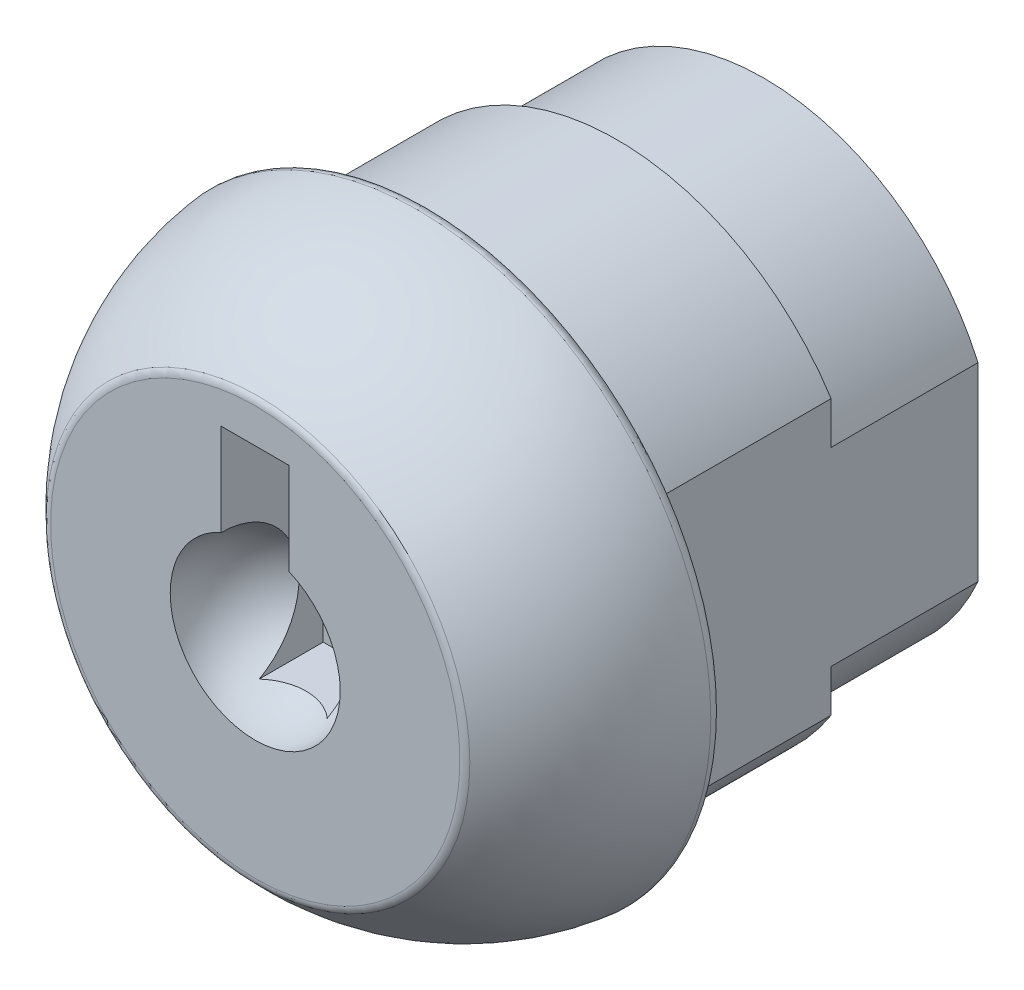
ISO-10303-21;
HEADER;
FILE_DESCRIPTION(('STEP AP214'),'2;1');
FILE_NAME('part.step','',(''),(''),'','','');
FILE_SCHEMA(('AUTOMOTIVE_DESIGN { 1 0 10303 214 1 1 1 1 }'));
ENDSEC;
DATA;
#1=APPLICATION_CONTEXT('core data for automotive mechanical design processes');
#2=APPLICATION_PROTOCOL_DEFINITION('international standard','automotive_design',2000,#1);
#3=PRODUCT_CONTEXT('',#1,'mechanical');
#4=PRODUCT('Part','Part','',(#3));
#5=PRODUCT_RELATED_PRODUCT_CATEGORY('part','',(#4));
#6=PRODUCT_DEFINITION_FORMATION('','',#4);
#7=PRODUCT_DEFINITION_CONTEXT('part definition',#1,'design');
#8=PRODUCT_DEFINITION('design','',#6,#7);
#9=PRODUCT_DEFINITION_SHAPE('','',#8);
#10=(LENGTH_UNIT() NAMED_UNIT(*) SI_UNIT(.MILLI.,.METRE.));
#11=(NAMED_UNIT(*) PLANE_ANGLE_UNIT() SI_UNIT($,.RADIAN.));
#12=(NAMED_UNIT(*) SI_UNIT($,.STERADIAN.) SOLID_ANGLE_UNIT());
#13=UNCERTAINTY_MEASURE_WITH_UNIT(LENGTH_MEASURE(1.E-05),#10,'distance_accuracy_value','');
#14=(GEOMETRIC_REPRESENTATION_CONTEXT(3) GLOBAL_UNCERTAINTY_ASSIGNED_CONTEXT((#13)) GLOBAL_UNIT_ASSIGNED_CONTEXT((#10,
#11,#12)) REPRESENTATION_CONTEXT('',''));
#15=CARTESIAN_POINT('',(0.,0.,0.));
#16=DIRECTION('',(0.,0.,1.));
#17=DIRECTION('',(1.,0.,0.));
#18=AXIS2_PLACEMENT_3D('',#15,#16,#17);
#19=CARTESIAN_POINT('',(0.,1.905,-3.81));
#20=DIRECTION('',(0.,0.,-1.));
#21=DIRECTION('',(-1.,0.,0.));
#22=AXIS2_PLACEMENT_3D('',#19,#20,#21);
#23=PLANE('',#22);
#24=DIRECTION('',(1.,0.,0.));
#25=VECTOR('',#24,1.);
#26=CARTESIAN_POINT('',(1.27,-2.54,-3.81));
#27=LINE('',#26,#25);
#28=CARTESIAN_POINT('',(-1.27,-2.54,-3.81));
#29=VERTEX_POINT('',#28);
#30=CARTESIAN_POINT('',(1.27,-2.54,-3.81));
#31=VERTEX_POINT('',#30);
#32=EDGE_CURVE('E132',#29,#31,#27,.T.);
#33=ORIENTED_EDGE('',*,*,#32,.T.);
#34=DIRECTION('',(0.,1.,0.));
#35=VECTOR('',#34,1.);
#36=CARTESIAN_POINT('',(1.26999999999999,6.35,-3.81));
#37=LINE('',#36,#35);
#38=CARTESIAN_POINT('',(1.26999999999999,6.35,-3.81));
#39=VERTEX_POINT('',#38);
#40=EDGE_CURVE('E140',#31,#39,#37,.T.);
#41=ORIENTED_EDGE('',*,*,#40,.T.);
#42=DIRECTION('',(1.,0.,0.));
#43=VECTOR('',#42,1.);
#44=CARTESIAN_POINT('',(-1.27,6.35,-3.81));
#45=LINE('',#44,#43);
#46=CARTESIAN_POINT('',(-1.27,6.35,-3.81));
#47=VERTEX_POINT('',#46);
#48=EDGE_CURVE('E133',#39,#47,#45,.F.);
#49=ORIENTED_EDGE('',*,*,#48,.T.);
#50=DIRECTION('',(0.,-1.,0.));
#51=VECTOR('',#50,1.);
#52=CARTESIAN_POINT('',(-1.27,-2.54,-3.81));
#53=LINE('',#52,#51);
#54=EDGE_CURVE('E151',#47,#29,#53,.T.);
#55=ORIENTED_EDGE('',*,*,#54,.T.);
#56=EDGE_LOOP('',(#33,#41,#49,#55));
#57=FACE_BOUND('',#56,.T.);
#58=ADVANCED_FACE('F17',(#57),#23,.F.);
#59=CARTESIAN_POINT('',(1.27,-2.54,0.));
#60=DIRECTION('',(0.,-1.,0.));
#61=DIRECTION('',(0.,0.,-1.));
#62=AXIS2_PLACEMENT_3D('',#59,#60,#61);
#63=PLANE('',#62);
#64=DIRECTION('',(0.,0.,1.));
#65=VECTOR('',#64,1.);
#66=CARTESIAN_POINT('',(1.27,-2.54,0.));
#67=LINE('',#66,#65);
#68=CARTESIAN_POINT('',(1.27,-2.54,-1.41990316571237));
#69=VERTEX_POINT('',#68);
#70=EDGE_CURVE('E144',#69,#31,#67,.F.);
#71=ORIENTED_EDGE('',*,*,#70,.T.);
#72=ORIENTED_EDGE('',*,*,#32,.F.);
#73=DIRECTION('',(0.,0.,1.));
#74=VECTOR('',#73,1.);
#75=CARTESIAN_POINT('',(-1.27,-2.54,0.));
#76=LINE('',#75,#74);
#77=CARTESIAN_POINT('',(-1.27,-2.54,-1.41990316571237));
#78=VERTEX_POINT('',#77);
#79=EDGE_CURVE('E137',#29,#78,#76,.T.);
#80=ORIENTED_EDGE('',*,*,#79,.T.);
#81=CARTESIAN_POINT('',(-1.27,-2.54,-1.41990316571237));
#82=CARTESIAN_POINT('',(-1.23005239120285,-2.53999999999996,-1.45563291230035));
#83=CARTESIAN_POINT('',(-1.18861561779617,-2.53999999999998,-1.48965920558386));
#84=CARTESIAN_POINT('',(-1.10302665983604,-2.54000000000002,-1.55410091556853));
#85=CARTESIAN_POINT('',(-1.05887460526792,-2.54000000000004,-1.58451650491651));
#86=CARTESIAN_POINT('',(-0.922877908145627,-2.53999999999992,-1.66995571271265));
#87=CARTESIAN_POINT('',(-0.827364296598273,-2.53999999999959,-1.71928641837805));
#88=CARTESIAN_POINT('',(-0.629412647813625,-2.5399999999996,-1.80121084091261));
#89=CARTESIAN_POINT('',(-0.526971245354933,-2.53999999999993,-1.83379635664315));
#90=CARTESIAN_POINT('',(-0.318085130877129,-2.54000000000007,-1.88130522008903));
#91=CARTESIAN_POINT('',(-0.211641452001605,-2.53999999999987,-1.89623309406985));
#92=CARTESIAN_POINT('',(0.00222574017568847,-2.53999999999983,-1.90800731092913));
#93=CARTESIAN_POINT('',(0.109649151579861,-2.53999999999998,-1.90485551325671));
#94=CARTESIAN_POINT('',(0.322497234244716,-2.54000000000002,-1.88055721191501));
#95=CARTESIAN_POINT('',(0.427920958750327,-2.5399999999999,-1.85940239186337));
#96=CARTESIAN_POINT('',(0.633759582405878,-2.5399999999999,-1.79968689943814));
#97=CARTESIAN_POINT('',(0.734171733447887,-2.54000000000002,-1.76111679131695));
#98=CARTESIAN_POINT('',(0.926995575443043,-2.53999999999998,-1.66767647457572));
#99=CARTESIAN_POINT('',(1.01941939561519,-2.53999999999983,-1.61283155917503));
#100=CARTESIAN_POINT('',(1.13493921988193,-2.53999999999992,-1.53041401042046));
#101=CARTESIAN_POINT('',(1.16282365004706,-2.53999999999997,-1.50933454702979));
#102=CARTESIAN_POINT('',(1.21734618272097,-2.54000000000003,-1.46571025642878));
#103=CARTESIAN_POINT('',(1.24398626833384,-2.54000000000004,-1.44316790788703));
#104=CARTESIAN_POINT('',(1.27,-2.54,-1.41990316571237));
#105=B_SPLINE_CURVE_WITH_KNOTS('',3,(#81,#82,#83,#84,#85,#86,#87,#88,#89,#90,#91,#92,#93,#94,
#95,#96,#97,#98,#99,#100,#101,#102,#103,#104),.UNSPECIFIED.,.F.,.F.,(4,2,2,2,2,2,2,2,2,2,2,4),
(0.,0.160686303204169,0.321364920049631,0.642212241852082,0.963216552710838,1.28413856119691,
1.60502756424722,1.92606488045706,2.24727634645931,2.56799119846663,2.67281974393884,
2.77747508810238),.UNSPECIFIED.);
#106=EDGE_CURVE('E213',#78,#69,#105,.T.);
#107=ORIENTED_EDGE('',*,*,#106,.T.);
#108=EDGE_LOOP('',(#71,#72,#80,#107));
#109=FACE_BOUND('',#108,.T.);
#110=ADVANCED_FACE('F221',(#109),#63,.F.);
#111=CARTESIAN_POINT('',(0.,8.7503,-13.5128));
#112=DIRECTION('',(0.,0.,-1.));
#113=DIRECTION('',(-1.,0.,0.));
#114=AXIS2_PLACEMENT_3D('',#111,#112,#113);
#115=PLANE('',#114);
#116=DIRECTION('',(0.,1.,0.));
#117=VECTOR('',#116,1.);
#118=CARTESIAN_POINT('',(-8.001,8.7503,-13.5128));
#119=LINE('',#118,#117);
#120=CARTESIAN_POINT('',(-8.001,3.54284477362473,-13.5128));
#121=VERTEX_POINT('',#120);
#122=CARTESIAN_POINT('',(-8.001,5.12191360723705,-13.5128));
#123=VERTEX_POINT('',#122);
#124=EDGE_CURVE('E92',#121,#123,#119,.T.);
#125=ORIENTED_EDGE('',*,*,#124,.T.);
#126=CARTESIAN_POINT('',(0.,0.,-13.5128));
#127=DIRECTION('',(0.,0.,-1.));
#128=DIRECTION('',(-1.,0.,0.));
#129=AXIS2_PLACEMENT_3D('',#126,#127,#128);
#130=CIRCLE('',#129,9.5);
#131=CARTESIAN_POINT('',(8.001,5.12191360723705,-13.5128));
#132=VERTEX_POINT('',#131);
#133=EDGE_CURVE('E129',#132,#123,#130,.F.);
#134=ORIENTED_EDGE('',*,*,#133,.F.);
#135=DIRECTION('',(0.,1.,0.));
#136=VECTOR('',#135,1.);
#137=CARTESIAN_POINT('',(8.001,8.7503,-13.5128));
#138=LINE('',#137,#136);
#139=CARTESIAN_POINT('',(8.001,3.54284477362474,-13.5128));
#140=VERTEX_POINT('',#139);
#141=EDGE_CURVE('E106',#132,#140,#138,.F.);
#142=ORIENTED_EDGE('',*,*,#141,.T.);
#143=CARTESIAN_POINT('',(0.,0.,-13.5128));
#144=DIRECTION('',(0.,0.,-1.));
#145=DIRECTION('',(-1.,0.,0.));
#146=AXIS2_PLACEMENT_3D('',#143,#144,#145);
#147=CIRCLE('',#146,8.7503);
#148=EDGE_CURVE('E21',#121,#140,#147,.T.);
#149=ORIENTED_EDGE('',*,*,#148,.F.);
#150=EDGE_LOOP('',(#125,#134,#142,#149));
#151=FACE_BOUND('',#150,.T.);
#152=ADVANCED_FACE('F110',(#151),#115,.T.);
#153=CARTESIAN_POINT('',(0.,8.7503,-13.5128));
#154=DIRECTION('',(0.,0.,-1.));
#155=DIRECTION('',(-1.,0.,0.));
#156=AXIS2_PLACEMENT_3D('',#153,#154,#155);
#157=PLANE('',#156);
#158=DIRECTION('',(0.,1.,0.));
#159=VECTOR('',#158,1.);
#160=CARTESIAN_POINT('',(-8.001,12.7,-13.5128));
#161=LINE('',#160,#159);
#162=CARTESIAN_POINT('',(-8.001,-3.54284477362473,-13.5128));
#163=VERTEX_POINT('',#162);
#164=CARTESIAN_POINT('',(-8.00099999999999,-5.12191360723705,-13.5128));
#165=VERTEX_POINT('',#164);
#166=EDGE_CURVE('E122',#163,#165,#161,.F.);
#167=ORIENTED_EDGE('',*,*,#166,.F.);
#168=CARTESIAN_POINT('',(0.,0.,-13.5128));
#169=DIRECTION('',(0.,0.,-1.));
#170=DIRECTION('',(-1.,0.,0.));
#171=AXIS2_PLACEMENT_3D('',#168,#169,#170);
#172=CIRCLE('',#171,8.7503);
#173=CARTESIAN_POINT('',(8.001,-3.54284477362473,-13.5128));
#174=VERTEX_POINT('',#173);
#175=EDGE_CURVE('E114',#174,#163,#172,.T.);
#176=ORIENTED_EDGE('',*,*,#175,.F.);
#177=DIRECTION('',(0.,1.,0.));
#178=VECTOR('',#177,1.);
#179=CARTESIAN_POINT('',(8.001,8.7503,-13.5128));
#180=LINE('',#179,#178);
#181=CARTESIAN_POINT('',(8.001,-5.12191360723705,-13.5128));
#182=VERTEX_POINT('',#181);
#183=EDGE_CURVE('E105',#174,#182,#180,.F.);
#184=ORIENTED_EDGE('',*,*,#183,.T.);
#185=CARTESIAN_POINT('',(0.,0.,-13.5128));
#186=DIRECTION('',(0.,0.,-1.));
#187=DIRECTION('',(-1.,0.,0.));
#188=AXIS2_PLACEMENT_3D('',#185,#186,#187);
#189=CIRCLE('',#188,9.5);
#190=EDGE_CURVE('E202',#165,#182,#189,.F.);
#191=ORIENTED_EDGE('',*,*,#190,.F.);
#192=EDGE_LOOP('',(#167,#176,#184,#191));
#193=FACE_BOUND('',#192,.T.);
#194=ADVANCED_FACE('F338',(#193),#157,.T.);
#195=CARTESIAN_POINT('',(0.,0.,-16.256));
#196=DIRECTION('',(0.,0.,-1.));
#197=DIRECTION('',(-1.,0.,0.));
#198=AXIS2_PLACEMENT_3D('',#195,#196,#197);
#199=CYLINDRICAL_SURFACE('',#198,8.7503);
#200=DIRECTION('',(0.,0.,1.));
#201=VECTOR('',#200,1.);
#202=CARTESIAN_POINT('',(-8.001,3.54284477362473,-18.9992));
#203=LINE('',#202,#201);
#204=CARTESIAN_POINT('',(-8.001,3.54284477362473,-18.9992));
#205=VERTEX_POINT('',#204);
#206=EDGE_CURVE('E97',#121,#205,#203,.F.);
#207=ORIENTED_EDGE('',*,*,#206,.F.);
#208=ORIENTED_EDGE('',*,*,#148,.T.);
#209=DIRECTION('',(0.,0.,1.));
#210=VECTOR('',#209,1.);
#211=CARTESIAN_POINT('',(8.001,3.54284477362475,-18.9992));
#212=LINE('',#211,#210);
#213=CARTESIAN_POINT('',(8.001,3.54284477362474,-18.9992));
#214=VERTEX_POINT('',#213);
#215=EDGE_CURVE('E205',#214,#140,#212,.T.);
#216=ORIENTED_EDGE('',*,*,#215,.F.);
#217=CARTESIAN_POINT('',(0.,0.,-18.9992));
#218=DIRECTION('',(0.,0.,-1.));
#219=DIRECTION('',(-1.,0.,0.));
#220=AXIS2_PLACEMENT_3D('',#217,#218,#219);
#221=CIRCLE('',#220,8.7503);
#222=EDGE_CURVE('E116',#205,#214,#221,.T.);
#223=ORIENTED_EDGE('',*,*,#222,.F.);
#224=EDGE_LOOP('',(#207,#208,#216,#223));
#225=FACE_BOUND('',#224,.T.);
#226=ADVANCED_FACE('F115',(#225),#199,.T.);
#227=CARTESIAN_POINT('',(0.,0.,-16.256));
#228=DIRECTION('',(0.,0.,-1.));
#229=DIRECTION('',(-1.,0.,0.));
#230=AXIS2_PLACEMENT_3D('',#227,#228,#229);
#231=CYLINDRICAL_SURFACE('',#230,8.7503);
#232=DIRECTION('',(0.,0.,1.));
#233=VECTOR('',#232,1.);
#234=CARTESIAN_POINT('',(-8.001,-3.54284477362473,-18.9992));
#235=LINE('',#234,#233);
#236=CARTESIAN_POINT('',(-8.001,-3.54284477362473,-18.9992));
#237=VERTEX_POINT('',#236);
#238=EDGE_CURVE('E127',#237,#163,#235,.T.);
#239=ORIENTED_EDGE('',*,*,#238,.F.);
#240=CARTESIAN_POINT('',(0.,0.,-18.9992));
#241=DIRECTION('',(0.,0.,-1.));
#242=DIRECTION('',(-1.,0.,0.));
#243=AXIS2_PLACEMENT_3D('',#240,#241,#242);
#244=CIRCLE('',#243,8.7503);
#245=CARTESIAN_POINT('',(8.001,-3.54284477362472,-18.9992));
#246=VERTEX_POINT('',#245);
#247=EDGE_CURVE('E344',#246,#237,#244,.T.);
#248=ORIENTED_EDGE('',*,*,#247,.F.);
#249=DIRECTION('',(0.,0.,1.));
#250=VECTOR('',#249,1.);
#251=CARTESIAN_POINT('',(8.001,-3.54284477362473,-18.9992));
#252=LINE('',#251,#250);
#253=EDGE_CURVE('E300',#174,#246,#252,.F.);
#254=ORIENTED_EDGE('',*,*,#253,.F.);
#255=ORIENTED_EDGE('',*,*,#175,.T.);
#256=EDGE_LOOP('',(#239,#248,#254,#255));
#257=FACE_BOUND('',#256,.T.);
#258=ADVANCED_FACE('F345',(#257),#231,.T.);
#259=CARTESIAN_POINT('',(0.,0.,-18.9992));
#260=DIRECTION('',(0.,0.,-1.));
#261=DIRECTION('',(-1.,0.,0.));
#262=AXIS2_PLACEMENT_3D('',#259,#260,#261);
#263=PLANE('',#262);
#264=DIRECTION('',(0.,1.,0.));
#265=VECTOR('',#264,1.);
#266=CARTESIAN_POINT('',(-8.001,12.7,-18.9992));
#267=LINE('',#266,#265);
#268=EDGE_CURVE('E118',#205,#237,#267,.F.);
#269=ORIENTED_EDGE('',*,*,#268,.F.);
#270=ORIENTED_EDGE('',*,*,#222,.T.);
#271=DIRECTION('',(0.,1.,0.));
#272=VECTOR('',#271,1.);
#273=CARTESIAN_POINT('',(8.001,-12.7,-18.9992));
#274=LINE('',#273,#272);
#275=EDGE_CURVE('E334',#246,#214,#274,.T.);
#276=ORIENTED_EDGE('',*,*,#275,.F.);
#277=ORIENTED_EDGE('',*,*,#247,.T.);
#278=EDGE_LOOP('',(#269,#270,#276,#277));
#279=FACE_BOUND('',#278,.T.);
#280=ADVANCED_FACE('F347',(#279),#263,.T.);
#281=CARTESIAN_POINT('',(-1.27,-2.54,0.));
#282=DIRECTION('',(-1.,0.,0.));
#283=DIRECTION('',(0.,-1.,0.));
#284=AXIS2_PLACEMENT_3D('',#281,#282,#283);
#285=PLANE('',#284);
#286=ORIENTED_EDGE('',*,*,#79,.F.);
#287=ORIENTED_EDGE('',*,*,#54,.F.);
#288=DIRECTION('',(0.,0.,1.));
#289=VECTOR('',#288,1.);
#290=CARTESIAN_POINT('',(-1.27,6.35,0.));
#291=LINE('',#290,#289);
#292=CARTESIAN_POINT('',(-1.27,6.35,0.));
#293=VERTEX_POINT('',#292);
#294=EDGE_CURVE('E136',#47,#293,#291,.T.);
#295=ORIENTED_EDGE('',*,*,#294,.T.);
#296=DIRECTION('',(0.,1.,0.));
#297=VECTOR('',#296,1.);
#298=CARTESIAN_POINT('',(-1.27,7.7978,0.));
#299=LINE('',#298,#297);
#300=CARTESIAN_POINT('',(-1.27,2.90993556629696,0.));
#301=VERTEX_POINT('',#300);
#302=EDGE_CURVE('E322',#301,#293,#299,.T.);
#303=ORIENTED_EDGE('',*,*,#302,.F.);
#304=CARTESIAN_POINT('',(-1.27,0.,0.));
#305=DIRECTION('',(1.,0.,0.));
#306=DIRECTION('',(0.,0.,-1.));
#307=AXIS2_PLACEMENT_3D('',#304,#305,#306);
#308=CIRCLE('',#307,2.90993556629696);
#309=EDGE_CURVE('E207',#301,#78,#308,.F.);
#310=ORIENTED_EDGE('',*,*,#309,.T.);
#311=EDGE_LOOP('',(#286,#287,#295,#303,#310));
#312=FACE_BOUND('',#311,.T.);
#313=ADVANCED_FACE('F349',(#312),#285,.F.);
#314=CARTESIAN_POINT('',(-1.27,6.35,0.));
#315=DIRECTION('',(0.,1.,0.));
#316=DIRECTION('',(0.,0.,1.));
#317=AXIS2_PLACEMENT_3D('',#314,#315,#316);
#318=PLANE('',#317);
#319=ORIENTED_EDGE('',*,*,#294,.F.);
#320=ORIENTED_EDGE('',*,*,#48,.F.);
#321=DIRECTION('',(0.,0.,1.));
#322=VECTOR('',#321,1.);
#323=CARTESIAN_POINT('',(1.26999999999999,6.35,0.));
#324=LINE('',#323,#322);
#325=CARTESIAN_POINT('',(1.26999999999999,6.35,0.));
#326=VERTEX_POINT('',#325);
#327=EDGE_CURVE('E143',#39,#326,#324,.T.);
#328=ORIENTED_EDGE('',*,*,#327,.T.);
#329=DIRECTION('',(1.,0.,0.));
#330=VECTOR('',#329,1.);
#331=CARTESIAN_POINT('',(0.,6.35,0.));
#332=LINE('',#331,#330);
#333=EDGE_CURVE('E319',#293,#326,#332,.T.);
#334=ORIENTED_EDGE('',*,*,#333,.F.);
#335=EDGE_LOOP('',(#319,#320,#328,#334));
#336=FACE_BOUND('',#335,.T.);
#337=ADVANCED_FACE('F355',(#336),#318,.F.);
#338=CARTESIAN_POINT('',(1.26999999999999,6.35,0.));
#339=DIRECTION('',(1.,0.,0.));
#340=DIRECTION('',(0.,1.,0.));
#341=AXIS2_PLACEMENT_3D('',#338,#339,#340);
#342=PLANE('',#341);
#343=DIRECTION('',(0.,1.,0.));
#344=VECTOR('',#343,1.);
#345=CARTESIAN_POINT('',(1.26999999999999,7.7978,0.));
#346=LINE('',#345,#344);
#347=CARTESIAN_POINT('',(1.27,2.90993556629696,0.));
#348=VERTEX_POINT('',#347);
#349=EDGE_CURVE('E201',#326,#348,#346,.F.);
#350=ORIENTED_EDGE('',*,*,#349,.F.);
#351=ORIENTED_EDGE('',*,*,#327,.F.);
#352=ORIENTED_EDGE('',*,*,#40,.F.);
#353=ORIENTED_EDGE('',*,*,#70,.F.);
#354=CARTESIAN_POINT('',(1.27,0.,0.));
#355=DIRECTION('',(1.,0.,0.));
#356=DIRECTION('',(0.,0.,-1.));
#357=AXIS2_PLACEMENT_3D('',#354,#355,#356);
#358=CIRCLE('',#357,2.90993556629696);
#359=EDGE_CURVE('E210',#69,#348,#358,.T.);
#360=ORIENTED_EDGE('',*,*,#359,.T.);
#361=EDGE_LOOP('',(#350,#351,#352,#353,#360));
#362=FACE_BOUND('',#361,.T.);
#363=ADVANCED_FACE('F418',(#362),#342,.F.);
#364=CARTESIAN_POINT('',(0.,0.,0.));
#365=DIRECTION('',(1.,0.,0.));
#366=DIRECTION('',(0.,1.,0.));
#367=AXIS2_PLACEMENT_3D('',#364,#365,#366);
#368=SPHERICAL_SURFACE('',#367,3.175);
#369=CARTESIAN_POINT('',(-3.175,0.,0.));
#370=CARTESIAN_POINT('',(-3.17500000000003,3.33333332803069E-05,0.));
#371=CARTESIAN_POINT('',(-3.17499999947508,6.66666666306802E-05,0.));
#372=CARTESIAN_POINT('',(-3.17499999632542,0.000166666666724524,0.));
#373=CARTESIAN_POINT('',(-3.17499999212587,0.000233333333474336,0.));
#374=CARTESIAN_POINT('',(-3.17499996063037,0.000566666666515808,0.));
#375=CARTESIAN_POINT('',(-3.17499990184117,0.000833333324733324,0.));
#376=CARTESIAN_POINT('',(-3.17499943987937,0.00216666676100235,0.));
#377=CARTESIAN_POINT('',(-3.1749985326594,0.00323333359367178,0.));
#378=CARTESIAN_POINT('',(-3.17499131029477,0.00856666993106899,0.));
#379=CARTESIAN_POINT('',(-3.17497693635597,0.0128333215782758,0.));
#380=CARTESIAN_POINT('',(-3.17486200728749,0.0341669966035385,0.));
#381=CARTESIAN_POINT('',(-3.17463227404222,0.0512337098725064,0.));
#382=CARTESIAN_POINT('',(-3.17279694426805,0.136583435530369,0.));
#383=CARTESIAN_POINT('',(-3.16913136292876,0.204814843444603,0.));
#384=CARTESIAN_POINT('',(-3.13953202479063,0.547469660113176,0.));
#385=CARTESIAN_POINT('',(-3.07977892956897,0.819773888969042,0.));
#386=CARTESIAN_POINT('',(-2.86437800589772,1.41539128035127,0.));
#387=CARTESIAN_POINT('',(-2.68592774612236,1.73056444620352,0.));
#388=CARTESIAN_POINT('',(-2.23405019272733,2.28394885944542,0.));
#389=CARTESIAN_POINT('',(-1.96062289910773,2.52216010683511,0.));
#390=CARTESIAN_POINT('',(-1.53261545251886,2.78457802440302,0.));
#391=CARTESIAN_POINT('',(-1.40325489852454,2.85207350867037,0.));
#392=CARTESIAN_POINT('',(-1.27,2.90993556629696,0.));
#393=B_SPLINE_CURVE_WITH_KNOTS('',3,(#369,#370,#371,#372,#373,#374,#375,#376,#377,#378,#379,
#380,#381,#382,#383,#384,#385,#386,#387,#388,#389,#390,#391,#392),.UNSPECIFIED.,.F.,.F.,(4,2,2,
2,2,2,2,2,2,2,2,4),(0.,9.99999999951784E-05,0.000300000000094684,0.00110000000644409,
0.00430000041276813,0.0171000264176894,0.0683016909102112,0.273208400682278,1.09943209136872,
2.16550619740217,3.23158030343489,3.66783788069315),.UNSPECIFIED.);
#394=CARTESIAN_POINT('',(-3.175,7.59965903273845E-08,0.));
#395=VERTEX_POINT('',#394);
#396=EDGE_CURVE('E195',#395,#301,#393,.T.);
#397=ORIENTED_EDGE('',*,*,#396,.F.);
#398=CARTESIAN_POINT('',(0.,0.,0.));
#399=DIRECTION('',(0.,0.,1.));
#400=DIRECTION('',(1.,0.,0.));
#401=AXIS2_PLACEMENT_3D('',#398,#399,#400);
#402=CIRCLE('',#401,3.175);
#403=CARTESIAN_POINT('',(3.17499999999903,6.13149312457322E-08,0.));
#404=VERTEX_POINT('',#403);
#405=EDGE_CURVE('E170',#404,#395,#402,.F.);
#406=ORIENTED_EDGE('',*,*,#405,.F.);
#407=CARTESIAN_POINT('',(1.27,2.90993556629696,0.));
#408=CARTESIAN_POINT('',(1.35185249645868,2.87422156020914,0.));
#409=CARTESIAN_POINT('',(1.43218729802662,2.83504018502866,0.));
#410=CARTESIAN_POINT('',(1.589269909542,2.75005572678145,0.));
#411=CARTESIAN_POINT('',(1.66601788655495,2.70425295253085,0.));
#412=CARTESIAN_POINT('',(1.81532205481624,2.60637527944113,0.));
#413=CARTESIAN_POINT('',(1.88788161470268,2.55430552797382,0.));
#414=CARTESIAN_POINT('',(2.02834352044916,2.44426233597416,0.));
#415=CARTESIAN_POINT('',(2.09624593165967,2.38628897831133,0.));
#416=CARTESIAN_POINT('',(2.29228445477849,2.20404738840254,0.));
#417=CARTESIAN_POINT('',(2.41282602134705,2.0714089240242,0.));
#418=CARTESIAN_POINT('',(2.62986882472853,1.78783046924955,0.));
#419=CARTESIAN_POINT('',(2.72636851607679,1.63688930324203,0.));
#420=CARTESIAN_POINT('',(2.89271270974438,1.32088455307511,0.));
#421=CARTESIAN_POINT('',(2.96254493291201,1.15581450593052,0.));
#422=CARTESIAN_POINT('',(3.07343361135663,0.816357678632866,0.));
#423=CARTESIAN_POINT('',(3.11451830327167,0.641980222237463,0.));
#424=CARTESIAN_POINT('',(3.1521163896682,0.388451616990085,0.));
#425=CARTESIAN_POINT('',(3.16070134453119,0.310930571169511,0.));
#426=CARTESIAN_POINT('',(3.17213629619058,0.155617905625638,0.));
#427=CARTESIAN_POINT('',(3.17499739759889,0.0778271036868942,0.));
#428=CARTESIAN_POINT('',(3.175,0.,0.));
#429=B_SPLINE_CURVE_WITH_KNOTS('',3,(#407,#408,#409,#410,#411,#412,#413,#414,#415,#416,#417,
#418,#419,#420,#421,#422,#423,#424,#425,#426,#427,#428),.UNSPECIFIED.,.F.,.F.,(4,2,2,2,2,2,2,2,
2,2,4),(0.,0.26782685801683,0.535641228856463,0.803237112957955,1.0708292413073,
1.60575065226125,2.14070644027429,2.67590825485034,3.21058363831953,3.44439407493084,
3.67775046396256),.UNSPECIFIED.);
#430=EDGE_CURVE('E36',#348,#404,#429,.T.);
#431=ORIENTED_EDGE('',*,*,#430,.F.);
#432=ORIENTED_EDGE('',*,*,#359,.F.);
#433=ORIENTED_EDGE('',*,*,#106,.F.);
#434=ORIENTED_EDGE('',*,*,#309,.F.);
#435=EDGE_LOOP('',(#397,#406,#431,#432,#433,#434));
#436=FACE_BOUND('',#435,.T.);
#437=ADVANCED_FACE('F172',(#436),#368,.F.);
#438=CARTESIAN_POINT('',(0.,0.,-10.0076));
#439=DIRECTION('',(0.,0.,-1.));
#440=DIRECTION('',(-1.,0.,0.));
#441=AXIS2_PLACEMENT_3D('',#438,#439,#440);
#442=CYLINDRICAL_SURFACE('',#441,9.5);
#443=DIRECTION('',(0.,0.,1.));
#444=VECTOR('',#443,1.);
#445=CARTESIAN_POINT('',(-8.001,5.12191360723706,-18.9992));
#446=LINE('',#445,#444);
#447=CARTESIAN_POINT('',(-8.001,5.12191360723705,-6.5024));
#448=VERTEX_POINT('',#447);
#449=EDGE_CURVE('E101',#448,#123,#446,.F.);
#450=ORIENTED_EDGE('',*,*,#449,.F.);
#451=CARTESIAN_POINT('',(0.,0.,-6.5024));
#452=DIRECTION('',(0.,0.,-1.));
#453=DIRECTION('',(-1.,0.,0.));
#454=AXIS2_PLACEMENT_3D('',#451,#452,#453);
#455=CIRCLE('',#454,9.5);
#456=CARTESIAN_POINT('',(8.001,5.12191360723705,-6.5024));
#457=VERTEX_POINT('',#456);
#458=EDGE_CURVE('E161',#457,#448,#455,.F.);
#459=ORIENTED_EDGE('',*,*,#458,.F.);
#460=DIRECTION('',(0.,0.,1.));
#461=VECTOR('',#460,1.);
#462=CARTESIAN_POINT('',(8.001,5.12191360723706,-18.9992));
#463=LINE('',#462,#461);
#464=EDGE_CURVE('E301',#132,#457,#463,.T.);
#465=ORIENTED_EDGE('',*,*,#464,.F.);
#466=ORIENTED_EDGE('',*,*,#133,.T.);
#467=EDGE_LOOP('',(#450,#459,#465,#466));
#468=FACE_BOUND('',#467,.T.);
#469=ADVANCED_FACE('F433',(#468),#442,.T.);
#470=CARTESIAN_POINT('',(-8.001,12.7,-18.9992));
#471=DIRECTION('',(-1.,0.,0.));
#472=DIRECTION('',(0.,0.,1.));
#473=AXIS2_PLACEMENT_3D('',#470,#471,#472);
#474=PLANE('',#473);
#475=ORIENTED_EDGE('',*,*,#206,.T.);
#476=ORIENTED_EDGE('',*,*,#268,.T.);
#477=ORIENTED_EDGE('',*,*,#238,.T.);
#478=ORIENTED_EDGE('',*,*,#166,.T.);
#479=DIRECTION('',(0.,0.,-1.));
#480=VECTOR('',#479,1.);
#481=CARTESIAN_POINT('',(-8.00099999999999,-5.12191360723706,-10.0076));
#482=LINE('',#481,#480);
#483=CARTESIAN_POINT('',(-8.00099999999999,-5.12191360723705,-6.5024));
#484=VERTEX_POINT('',#483);
#485=EDGE_CURVE('E120',#484,#165,#482,.T.);
#486=ORIENTED_EDGE('',*,*,#485,.F.);
#487=DIRECTION('',(0.,1.,0.));
#488=VECTOR('',#487,1.);
#489=CARTESIAN_POINT('',(-8.001,9.5,-6.5024));
#490=LINE('',#489,#488);
#491=EDGE_CURVE('E160',#448,#484,#490,.F.);
#492=ORIENTED_EDGE('',*,*,#491,.F.);
#493=ORIENTED_EDGE('',*,*,#449,.T.);
#494=ORIENTED_EDGE('',*,*,#124,.F.);
#495=EDGE_LOOP('',(#475,#476,#477,#478,#486,#492,#493,#494));
#496=FACE_BOUND('',#495,.T.);
#497=ADVANCED_FACE('F94',(#496),#474,.T.);
#498=CARTESIAN_POINT('',(0.,0.,-10.0076));
#499=DIRECTION('',(0.,0.,-1.));
#500=DIRECTION('',(-1.,0.,0.));
#501=AXIS2_PLACEMENT_3D('',#498,#499,#500);
#502=CYLINDRICAL_SURFACE('',#501,9.5);
#503=ORIENTED_EDGE('',*,*,#485,.T.);
#504=ORIENTED_EDGE('',*,*,#190,.T.);
#505=DIRECTION('',(0.,0.,1.));
#506=VECTOR('',#505,1.);
#507=CARTESIAN_POINT('',(8.001,-5.12191360723706,-18.9992));
#508=LINE('',#507,#506);
#509=CARTESIAN_POINT('',(8.001,-5.12191360723705,-6.5024));
#510=VERTEX_POINT('',#509);
#511=EDGE_CURVE('E297',#510,#182,#508,.F.);
#512=ORIENTED_EDGE('',*,*,#511,.F.);
#513=CARTESIAN_POINT('',(0.,0.,-6.5024));
#514=DIRECTION('',(0.,0.,-1.));
#515=DIRECTION('',(-1.,0.,0.));
#516=AXIS2_PLACEMENT_3D('',#513,#514,#515);
#517=CIRCLE('',#516,9.5);
#518=EDGE_CURVE('E156',#484,#510,#517,.F.);
#519=ORIENTED_EDGE('',*,*,#518,.F.);
#520=EDGE_LOOP('',(#503,#504,#512,#519));
#521=FACE_BOUND('',#520,.T.);
#522=ADVANCED_FACE('F295',(#521),#502,.T.);
#523=CARTESIAN_POINT('',(8.001,-12.7,-18.9992));
#524=DIRECTION('',(1.,0.,0.));
#525=DIRECTION('',(0.,1.,0.));
#526=AXIS2_PLACEMENT_3D('',#523,#524,#525);
#527=PLANE('',#526);
#528=ORIENTED_EDGE('',*,*,#253,.T.);
#529=ORIENTED_EDGE('',*,*,#275,.T.);
#530=ORIENTED_EDGE('',*,*,#215,.T.);
#531=ORIENTED_EDGE('',*,*,#141,.F.);
#532=ORIENTED_EDGE('',*,*,#464,.T.);
#533=DIRECTION('',(0.,1.,0.));
#534=VECTOR('',#533,1.);
#535=CARTESIAN_POINT('',(8.001,9.5,-6.5024));
#536=LINE('',#535,#534);
#537=EDGE_CURVE('E159',#510,#457,#536,.T.);
#538=ORIENTED_EDGE('',*,*,#537,.F.);
#539=ORIENTED_EDGE('',*,*,#511,.T.);
#540=ORIENTED_EDGE('',*,*,#183,.F.);
#541=EDGE_LOOP('',(#528,#529,#530,#531,#532,#538,#539,#540));
#542=FACE_BOUND('',#541,.T.);
#543=ADVANCED_FACE('F183',(#542),#527,.T.);
#544=CARTESIAN_POINT('',(0.,7.7978,0.));
#545=DIRECTION('',(0.,0.,1.));
#546=DIRECTION('',(1.,0.,0.));
#547=AXIS2_PLACEMENT_3D('',#544,#545,#546);
#548=PLANE('',#547);
#549=CARTESIAN_POINT('',(0.,0.,0.));
#550=DIRECTION('',(0.,0.,-1.));
#551=DIRECTION('',(0.,1.,0.));
#552=AXIS2_PLACEMENT_3D('',#549,#550,#551);
#553=CIRCLE('',#552,7.64587018472991);
#554=CARTESIAN_POINT('',(0.,7.64587018472991,0.));
#555=VERTEX_POINT('',#554);
#556=EDGE_CURVE('E250',#555,#555,#553,.T.);
#557=ORIENTED_EDGE('',*,*,#556,.F.);
#558=EDGE_LOOP('',(#557));
#559=FACE_BOUND('',#558,.T.);
#560=ORIENTED_EDGE('',*,*,#349,.T.);
#561=ORIENTED_EDGE('',*,*,#430,.T.);
#562=ORIENTED_EDGE('',*,*,#405,.T.);
#563=ORIENTED_EDGE('',*,*,#396,.T.);
#564=ORIENTED_EDGE('',*,*,#302,.T.);
#565=ORIENTED_EDGE('',*,*,#333,.T.);
#566=EDGE_LOOP('',(#560,#561,#562,#563,#564,#565));
#567=FACE_BOUND('',#566,.T.);
#568=ADVANCED_FACE('F177',(#559,#567),#548,.T.);
#569=CARTESIAN_POINT('',(0.,9.5,-6.5024));
#570=DIRECTION('',(0.,0.,-1.));
#571=DIRECTION('',(-1.,0.,0.));
#572=AXIS2_PLACEMENT_3D('',#569,#570,#571);
#573=PLANE('',#572);
#574=CARTESIAN_POINT('',(0.,0.,-6.5024));
#575=DIRECTION('',(0.,0.,1.));
#576=DIRECTION('',(0.727482678983834,0.686126046567614,0.));
#577=AXIS2_PLACEMENT_3D('',#574,#575,#576);
#578=CIRCLE('',#577,10.5638289258128);
#579=CARTESIAN_POINT('',(7.68500256727723,7.24811817748456,-6.5024));
#580=VERTEX_POINT('',#579);
#581=EDGE_CURVE('E247',#580,#580,#578,.T.);
#582=ORIENTED_EDGE('',*,*,#581,.F.);
#583=EDGE_LOOP('',(#582));
#584=FACE_BOUND('',#583,.T.);
#585=ORIENTED_EDGE('',*,*,#518,.T.);
#586=ORIENTED_EDGE('',*,*,#537,.T.);
#587=ORIENTED_EDGE('',*,*,#458,.T.);
#588=ORIENTED_EDGE('',*,*,#491,.T.);
#589=EDGE_LOOP('',(#585,#586,#587,#588));
#590=FACE_BOUND('',#589,.T.);
#591=ADVANCED_FACE('F182',(#584,#590),#573,.T.);
#592=CARTESIAN_POINT('',(0.,0.,-0.396875));
#593=DIRECTION('',(0.,0.,-1.));
#594=DIRECTION('',(-1.,0.,0.));
#595=AXIS2_PLACEMENT_3D('',#592,#593,#594);
#596=TOROIDAL_SURFACE('',#595,7.64587018472991,0.396875);
#597=CARTESIAN_POINT('',(0.,0.,-0.103646315326424));
#598=DIRECTION('',(0.,0.,1.));
#599=DIRECTION('',(1.,0.,0.));
#600=AXIS2_PLACEMENT_3D('',#597,#598,#599);
#601=CIRCLE('',#600,7.91331495306463);
#602=CARTESIAN_POINT('',(7.91331495306463,0.,-0.103646315326424));
#603=VERTEX_POINT('',#602);
#604=EDGE_CURVE('E27',#603,#603,#601,.T.);
#605=ORIENTED_EDGE('',*,*,#604,.T.);
#606=EDGE_LOOP('',(#605));
#607=FACE_BOUND('',#606,.T.);
#608=ORIENTED_EDGE('',*,*,#556,.T.);
#609=EDGE_LOOP('',(#608));
#610=FACE_BOUND('',#609,.T.);
#611=ADVANCED_FACE('F238',(#607,#610),#596,.T.);
#612=CARTESIAN_POINT('',(0.,0.,-6.105525));
#613=DIRECTION('',(0.,0.,-1.));
#614=DIRECTION('',(-1.,0.,0.));
#615=AXIS2_PLACEMENT_3D('',#612,#613,#614);
#616=TOROIDAL_SURFACE('',#615,10.5638289258128,0.396875);
#617=ORIENTED_EDGE('',*,*,#581,.T.);
#618=EDGE_LOOP('',(#617));
#619=FACE_BOUND('',#618,.T.);
#620=CARTESIAN_POINT('',(0.,0.,-6.06049848923946));
#621=DIRECTION('',(0.,0.,-1.));
#622=DIRECTION('',(-1.,0.,0.));
#623=AXIS2_PLACEMENT_3D('',#620,#621,#622);
#624=CIRCLE('',#623,10.958141465499);
#625=CARTESIAN_POINT('',(-10.958141465499,0.,-6.06049848923946));
#626=VERTEX_POINT('',#625);
#627=EDGE_CURVE('E11',#626,#626,#624,.T.);
#628=ORIENTED_EDGE('',*,*,#627,.T.);
#629=EDGE_LOOP('',(#628));
#630=FACE_BOUND('',#629,.T.);
#631=ADVANCED_FACE('F233',(#619,#630),#616,.T.);
#632=CARTESIAN_POINT('',(0.,0.,-7.14113474749228));
#633=DIRECTION('',(0.,0.,-1.));
#634=DIRECTION('',(-1.,0.,0.));
#635=AXIS2_PLACEMENT_3D('',#632,#633,#634);
#636=DEGENERATE_TOROIDAL_SURFACE('',#635,1.49464051303159,9.52500000000008,.T.);
#637=ORIENTED_EDGE('',*,*,#604,.F.);
#638=EDGE_LOOP('',(#637));
#639=FACE_BOUND('',#638,.T.);
#640=ORIENTED_EDGE('',*,*,#627,.F.);
#641=EDGE_LOOP('',(#640));
#642=FACE_BOUND('',#641,.T.);
#643=ADVANCED_FACE('F19',(#639,#642),#636,.T.);
#644=CLOSED_SHELL('',(#58,#110,#152,#194,#226,#258,#280,#313,#337,#363,#437,#469,#497,#522,#543,
#568,#591,#611,#631,#643));
#645=MANIFOLD_SOLID_BREP('B1',#644);
#646=ADVANCED_BREP_SHAPE_REPRESENTATION('',(#18,#645),#14);
#647=SHAPE_DEFINITION_REPRESENTATION(#9,#646);
ENDSEC;
END-ISO-10303-21;
